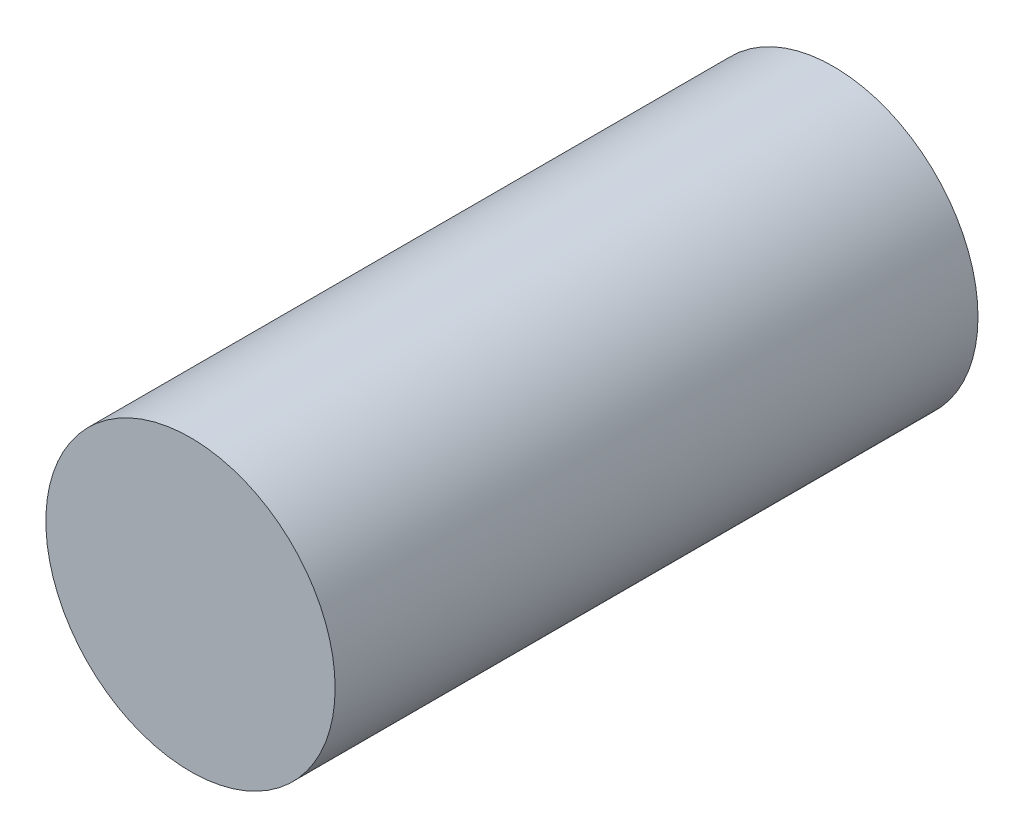
ISO-10303-21;
HEADER;
FILE_DESCRIPTION(('STEP AP214'),'2;1');
FILE_NAME('part.step','',(''),(''),'','','');
FILE_SCHEMA(('AUTOMOTIVE_DESIGN { 1 0 10303 214 1 1 1 1 }'));
ENDSEC;
DATA;
#1=APPLICATION_CONTEXT('core data for automotive mechanical design processes');
#2=APPLICATION_PROTOCOL_DEFINITION('international standard','automotive_design',2000,#1);
#3=PRODUCT_CONTEXT('',#1,'mechanical');
#4=PRODUCT('Part','Part','',(#3));
#5=PRODUCT_RELATED_PRODUCT_CATEGORY('part','',(#4));
#6=PRODUCT_DEFINITION_FORMATION('','',#4);
#7=PRODUCT_DEFINITION_CONTEXT('part definition',#1,'design');
#8=PRODUCT_DEFINITION('design','',#6,#7);
#9=PRODUCT_DEFINITION_SHAPE('','',#8);
#10=(LENGTH_UNIT() NAMED_UNIT(*) SI_UNIT(.MILLI.,.METRE.));
#11=(NAMED_UNIT(*) PLANE_ANGLE_UNIT() SI_UNIT($,.RADIAN.));
#12=(NAMED_UNIT(*) SI_UNIT($,.STERADIAN.) SOLID_ANGLE_UNIT());
#13=UNCERTAINTY_MEASURE_WITH_UNIT(LENGTH_MEASURE(1.E-05),#10,'distance_accuracy_value','');
#14=(GEOMETRIC_REPRESENTATION_CONTEXT(3) GLOBAL_UNCERTAINTY_ASSIGNED_CONTEXT((#13)) GLOBAL_UNIT_ASSIGNED_CONTEXT((#10,
#11,#12)) REPRESENTATION_CONTEXT('',''));
#15=CARTESIAN_POINT('',(0.,0.,0.));
#16=DIRECTION('',(0.,0.,1.));
#17=DIRECTION('',(1.,0.,0.));
#18=AXIS2_PLACEMENT_3D('',#15,#16,#17);
#19=CARTESIAN_POINT('',(0.,0.,20.));
#20=DIRECTION('',(0.,0.,-1.));
#21=DIRECTION('',(-1.,0.,0.));
#22=AXIS2_PLACEMENT_3D('',#19,#20,#21);
#23=CYLINDRICAL_SURFACE('',#22,4.5);
#24=CARTESIAN_POINT('',(0.,0.,20.));
#25=DIRECTION('',(0.,0.,1.));
#26=DIRECTION('',(1.,0.,0.));
#27=AXIS2_PLACEMENT_3D('',#24,#25,#26);
#28=CIRCLE('',#27,4.5);
#29=CARTESIAN_POINT('',(4.5,0.,20.));
#30=VERTEX_POINT('',#29);
#31=EDGE_CURVE('E10',#30,#30,#28,.T.);
#32=ORIENTED_EDGE('',*,*,#31,.F.);
#33=EDGE_LOOP('',(#32));
#34=FACE_BOUND('',#33,.T.);
#35=CARTESIAN_POINT('',(0.,0.,0.));
#36=DIRECTION('',(0.,0.,1.));
#37=DIRECTION('',(1.,0.,0.));
#38=AXIS2_PLACEMENT_3D('',#35,#36,#37);
#39=CIRCLE('',#38,4.5);
#40=CARTESIAN_POINT('',(4.5,0.,0.));
#41=VERTEX_POINT('',#40);
#42=EDGE_CURVE('E34',#41,#41,#39,.T.);
#43=ORIENTED_EDGE('',*,*,#42,.T.);
#44=EDGE_LOOP('',(#43));
#45=FACE_BOUND('',#44,.T.);
#46=ADVANCED_FACE('F31',(#34,#45),#23,.T.);
#47=CARTESIAN_POINT('',(0.,0.,20.));
#48=DIRECTION('',(0.,0.,1.));
#49=DIRECTION('',(1.,0.,0.));
#50=AXIS2_PLACEMENT_3D('',#47,#48,#49);
#51=PLANE('',#50);
#52=ORIENTED_EDGE('',*,*,#31,.T.);
#53=EDGE_LOOP('',(#52));
#54=FACE_BOUND('',#53,.T.);
#55=ADVANCED_FACE('F46',(#54),#51,.T.);
#56=CARTESIAN_POINT('',(0.,0.,0.));
#57=DIRECTION('',(0.,0.,1.));
#58=DIRECTION('',(1.,0.,0.));
#59=AXIS2_PLACEMENT_3D('',#56,#57,#58);
#60=PLANE('',#59);
#61=ORIENTED_EDGE('',*,*,#42,.F.);
#62=EDGE_LOOP('',(#61));
#63=FACE_BOUND('',#62,.T.);
#64=ADVANCED_FACE('F44',(#63),#60,.F.);
#65=CLOSED_SHELL('',(#46,#55,#64));
#66=MANIFOLD_SOLID_BREP('B2',#65);
#67=ADVANCED_BREP_SHAPE_REPRESENTATION('',(#18,#66),#14);
#68=SHAPE_DEFINITION_REPRESENTATION(#9,#67);
ENDSEC;
END-ISO-10303-21;
